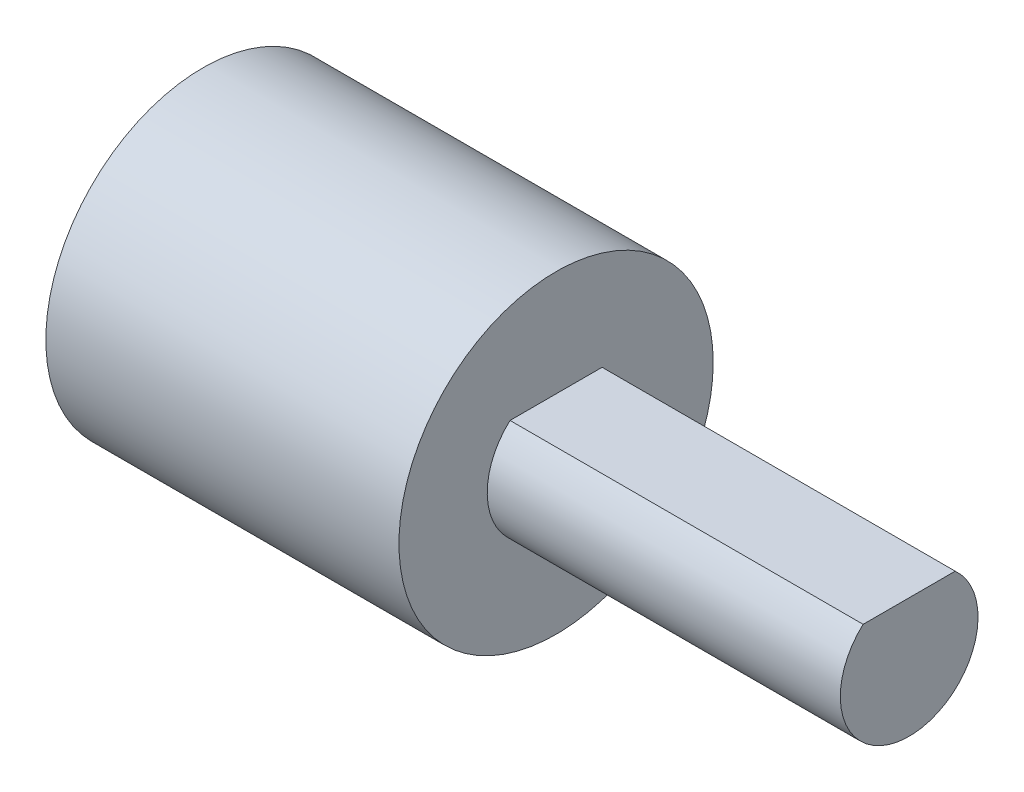
ISO-10303-21;
HEADER;
FILE_DESCRIPTION(('STEP AP214'),'2;1');
FILE_NAME('part.step','',(''),(''),'','','');
FILE_SCHEMA(('AUTOMOTIVE_DESIGN { 1 0 10303 214 1 1 1 1 }'));
ENDSEC;
DATA;
#1=APPLICATION_CONTEXT('core data for automotive mechanical design processes');
#2=APPLICATION_PROTOCOL_DEFINITION('international standard','automotive_design',2000,#1);
#3=PRODUCT_CONTEXT('',#1,'mechanical');
#4=PRODUCT('Part','Part','',(#3));
#5=PRODUCT_RELATED_PRODUCT_CATEGORY('part','',(#4));
#6=PRODUCT_DEFINITION_FORMATION('','',#4);
#7=PRODUCT_DEFINITION_CONTEXT('part definition',#1,'design');
#8=PRODUCT_DEFINITION('design','',#6,#7);
#9=PRODUCT_DEFINITION_SHAPE('','',#8);
#10=(LENGTH_UNIT() NAMED_UNIT(*) SI_UNIT(.MILLI.,.METRE.));
#11=(NAMED_UNIT(*) PLANE_ANGLE_UNIT() SI_UNIT($,.RADIAN.));
#12=(NAMED_UNIT(*) SI_UNIT($,.STERADIAN.) SOLID_ANGLE_UNIT());
#13=UNCERTAINTY_MEASURE_WITH_UNIT(LENGTH_MEASURE(1.E-05),#10,'distance_accuracy_value','');
#14=(GEOMETRIC_REPRESENTATION_CONTEXT(3) GLOBAL_UNCERTAINTY_ASSIGNED_CONTEXT((#13)) GLOBAL_UNIT_ASSIGNED_CONTEXT((#10,
#11,#12)) REPRESENTATION_CONTEXT('',''));
#15=CARTESIAN_POINT('',(0.,0.,0.));
#16=DIRECTION('',(0.,0.,1.));
#17=DIRECTION('',(1.,0.,0.));
#18=AXIS2_PLACEMENT_3D('',#15,#16,#17);
#19=CARTESIAN_POINT('',(10.,1.45,0.));
#20=DIRECTION('',(0.,1.,0.));
#21=DIRECTION('',(0.,0.,1.));
#22=AXIS2_PLACEMENT_3D('',#19,#20,#21);
#23=PLANE('',#22);
#24=DIRECTION('',(0.,0.,-1.));
#25=VECTOR('',#24,1.);
#26=CARTESIAN_POINT('',(0.,1.45,0.));
#27=LINE('',#26,#25);
#28=CARTESIAN_POINT('',(0.,1.45,1.30384048104053));
#29=VERTEX_POINT('',#28);
#30=CARTESIAN_POINT('',(0.,1.45,-1.30384048104053));
#31=VERTEX_POINT('',#30);
#32=EDGE_CURVE('E68',#29,#31,#27,.T.);
#33=ORIENTED_EDGE('',*,*,#32,.F.);
#34=DIRECTION('',(-1.,0.,0.));
#35=VECTOR('',#34,1.);
#36=CARTESIAN_POINT('',(10.,1.45,1.30384048104053));
#37=LINE('',#36,#35);
#38=CARTESIAN_POINT('',(10.,1.45,1.30384048104053));
#39=VERTEX_POINT('',#38);
#40=EDGE_CURVE('E11',#39,#29,#37,.T.);
#41=ORIENTED_EDGE('',*,*,#40,.F.);
#42=DIRECTION('',(0.,0.,-1.));
#43=VECTOR('',#42,1.);
#44=CARTESIAN_POINT('',(10.,1.45,0.));
#45=LINE('',#44,#43);
#46=CARTESIAN_POINT('',(10.,1.45,-1.30384048104053));
#47=VERTEX_POINT('',#46);
#48=EDGE_CURVE('E76',#39,#47,#45,.T.);
#49=ORIENTED_EDGE('',*,*,#48,.T.);
#50=DIRECTION('',(-1.,0.,0.));
#51=VECTOR('',#50,1.);
#52=CARTESIAN_POINT('',(10.,1.45,-1.30384048104053));
#53=LINE('',#52,#51);
#54=EDGE_CURVE('E50',#47,#31,#53,.T.);
#55=ORIENTED_EDGE('',*,*,#54,.T.);
#56=EDGE_LOOP('',(#33,#41,#49,#55));
#57=FACE_BOUND('',#56,.T.);
#58=ADVANCED_FACE('F41',(#57),#23,.T.);
#59=CARTESIAN_POINT('',(10.,0.,0.));
#60=DIRECTION('',(-1.,0.,0.));
#61=DIRECTION('',(0.,0.,1.));
#62=AXIS2_PLACEMENT_3D('',#59,#60,#61);
#63=CYLINDRICAL_SURFACE('',#62,1.95);
#64=CARTESIAN_POINT('',(0.,0.,0.));
#65=DIRECTION('',(1.,0.,0.));
#66=DIRECTION('',(0.,0.,-1.));
#67=AXIS2_PLACEMENT_3D('',#64,#65,#66);
#68=CIRCLE('',#67,1.95);
#69=EDGE_CURVE('E66',#29,#31,#68,.T.);
#70=ORIENTED_EDGE('',*,*,#69,.T.);
#71=ORIENTED_EDGE('',*,*,#54,.F.);
#72=CARTESIAN_POINT('',(10.,0.,0.));
#73=DIRECTION('',(1.,0.,0.));
#74=DIRECTION('',(0.,0.,-1.));
#75=AXIS2_PLACEMENT_3D('',#72,#73,#74);
#76=CIRCLE('',#75,1.95);
#77=EDGE_CURVE('E56',#39,#47,#76,.T.);
#78=ORIENTED_EDGE('',*,*,#77,.F.);
#79=ORIENTED_EDGE('',*,*,#40,.T.);
#80=EDGE_LOOP('',(#70,#71,#78,#79));
#81=FACE_BOUND('',#80,.T.);
#82=ADVANCED_FACE('F79',(#81),#63,.T.);
#83=CARTESIAN_POINT('',(10.,0.,0.));
#84=DIRECTION('',(1.,0.,0.));
#85=DIRECTION('',(0.,0.,-1.));
#86=AXIS2_PLACEMENT_3D('',#83,#84,#85);
#87=PLANE('',#86);
#88=ORIENTED_EDGE('',*,*,#48,.F.);
#89=ORIENTED_EDGE('',*,*,#77,.T.);
#90=EDGE_LOOP('',(#88,#89));
#91=FACE_BOUND('',#90,.T.);
#92=ADVANCED_FACE('F110',(#91),#87,.T.);
#93=CARTESIAN_POINT('',(0.,0.,0.));
#94=DIRECTION('',(1.,0.,0.));
#95=DIRECTION('',(0.,0.,-1.));
#96=AXIS2_PLACEMENT_3D('',#93,#94,#95);
#97=PLANE('',#96);
#98=CARTESIAN_POINT('',(0.,0.,0.));
#99=DIRECTION('',(1.,0.,0.));
#100=DIRECTION('',(0.,0.,-1.));
#101=AXIS2_PLACEMENT_3D('',#98,#99,#100);
#102=CIRCLE('',#101,4.45);
#103=CARTESIAN_POINT('',(0.,0.,-4.45));
#104=VERTEX_POINT('',#103);
#105=EDGE_CURVE('E87',#104,#104,#102,.T.);
#106=ORIENTED_EDGE('',*,*,#105,.T.);
#107=EDGE_LOOP('',(#106));
#108=FACE_BOUND('',#107,.T.);
#109=ORIENTED_EDGE('',*,*,#69,.F.);
#110=ORIENTED_EDGE('',*,*,#32,.T.);
#111=EDGE_LOOP('',(#109,#110));
#112=FACE_BOUND('',#111,.T.);
#113=ADVANCED_FACE('F70',(#108,#112),#97,.T.);
#114=CARTESIAN_POINT('',(-10.,0.,0.));
#115=DIRECTION('',(1.,0.,0.));
#116=DIRECTION('',(0.,0.,-1.));
#117=AXIS2_PLACEMENT_3D('',#114,#115,#116);
#118=CYLINDRICAL_SURFACE('',#117,4.45);
#119=CARTESIAN_POINT('',(-10.,0.,0.));
#120=DIRECTION('',(1.,0.,0.));
#121=DIRECTION('',(0.,0.,-1.));
#122=AXIS2_PLACEMENT_3D('',#119,#120,#121);
#123=CIRCLE('',#122,4.45);
#124=CARTESIAN_POINT('',(-10.,0.,-4.45));
#125=VERTEX_POINT('',#124);
#126=EDGE_CURVE('E73',#125,#125,#123,.T.);
#127=ORIENTED_EDGE('',*,*,#126,.T.);
#128=EDGE_LOOP('',(#127));
#129=FACE_BOUND('',#128,.T.);
#130=ORIENTED_EDGE('',*,*,#105,.F.);
#131=EDGE_LOOP('',(#130));
#132=FACE_BOUND('',#131,.T.);
#133=ADVANCED_FACE('F95',(#129,#132),#118,.T.);
#134=CARTESIAN_POINT('',(-10.,0.,0.));
#135=DIRECTION('',(1.,0.,0.));
#136=DIRECTION('',(0.,0.,-1.));
#137=AXIS2_PLACEMENT_3D('',#134,#135,#136);
#138=PLANE('',#137);
#139=ORIENTED_EDGE('',*,*,#126,.F.);
#140=EDGE_LOOP('',(#139));
#141=FACE_BOUND('',#140,.T.);
#142=ADVANCED_FACE('F98',(#141),#138,.F.);
#143=CLOSED_SHELL('',(#58,#82,#92,#113,#133,#142));
#144=MANIFOLD_SOLID_BREP('B2',#143);
#145=ADVANCED_BREP_SHAPE_REPRESENTATION('',(#18,#144),#14);
#146=SHAPE_DEFINITION_REPRESENTATION(#9,#145);
ENDSEC;
END-ISO-10303-21;
